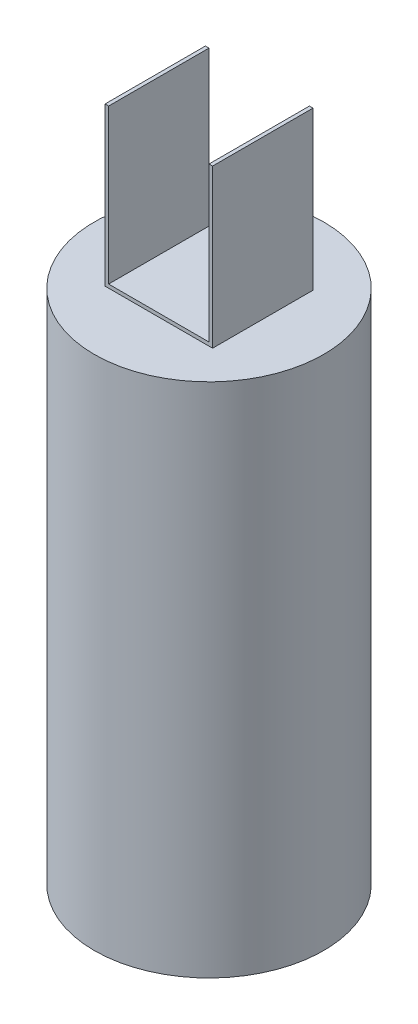
ISO-10303-21;
HEADER;
FILE_DESCRIPTION(('STEP AP214'),'2;1');
FILE_NAME('part.step','',(''),(''),'','','');
FILE_SCHEMA(('AUTOMOTIVE_DESIGN { 1 0 10303 214 1 1 1 1 }'));
ENDSEC;
DATA;
#1=APPLICATION_CONTEXT('core data for automotive mechanical design processes');
#2=APPLICATION_PROTOCOL_DEFINITION('international standard','automotive_design',2000,#1);
#3=PRODUCT_CONTEXT('',#1,'mechanical');
#4=PRODUCT('Part','Part','',(#3));
#5=PRODUCT_RELATED_PRODUCT_CATEGORY('part','',(#4));
#6=PRODUCT_DEFINITION_FORMATION('','',#4);
#7=PRODUCT_DEFINITION_CONTEXT('part definition',#1,'design');
#8=PRODUCT_DEFINITION('design','',#6,#7);
#9=PRODUCT_DEFINITION_SHAPE('','',#8);
#10=(LENGTH_UNIT() NAMED_UNIT(*) SI_UNIT(.MILLI.,.METRE.));
#11=(NAMED_UNIT(*) PLANE_ANGLE_UNIT() SI_UNIT($,.RADIAN.));
#12=(NAMED_UNIT(*) SI_UNIT($,.STERADIAN.) SOLID_ANGLE_UNIT());
#13=UNCERTAINTY_MEASURE_WITH_UNIT(LENGTH_MEASURE(1.E-05),#10,'distance_accuracy_value','');
#14=(GEOMETRIC_REPRESENTATION_CONTEXT(3) GLOBAL_UNCERTAINTY_ASSIGNED_CONTEXT((#13)) GLOBAL_UNIT_ASSIGNED_CONTEXT((#10,
#11,#12)) REPRESENTATION_CONTEXT('',''));
#15=CARTESIAN_POINT('',(0.,0.,0.));
#16=DIRECTION('',(0.,0.,1.));
#17=DIRECTION('',(1.,0.,0.));
#18=AXIS2_PLACEMENT_3D('',#15,#16,#17);
#19=CARTESIAN_POINT('',(0.,457.2,0.));
#20=DIRECTION('',(0.,1.,0.));
#21=DIRECTION('',(0.,0.,1.));
#22=AXIS2_PLACEMENT_3D('',#19,#20,#21);
#23=PLANE('',#22);
#24=CARTESIAN_POINT('',(0.,457.2,0.));
#25=DIRECTION('',(0.,1.,0.));
#26=DIRECTION('',(0.,0.,1.));
#27=AXIS2_PLACEMENT_3D('',#24,#25,#26);
#28=CIRCLE('',#27,101.6);
#29=CARTESIAN_POINT('',(0.,457.2,101.6));
#30=VERTEX_POINT('',#29);
#31=EDGE_CURVE('E11',#30,#30,#28,.T.);
#32=ORIENTED_EDGE('',*,*,#31,.T.);
#33=EDGE_LOOP('',(#32));
#34=FACE_BOUND('',#33,.T.);
#35=DIRECTION('',(1.,0.,0.));
#36=VECTOR('',#35,1.);
#37=CARTESIAN_POINT('',(0.,457.2,44.45));
#38=LINE('',#37,#36);
#39=CARTESIAN_POINT('',(-47.625,457.2,44.45));
#40=VERTEX_POINT('',#39);
#41=CARTESIAN_POINT('',(47.625,457.2,44.45));
#42=VERTEX_POINT('',#41);
#43=EDGE_CURVE('E137',#40,#42,#38,.T.);
#44=ORIENTED_EDGE('',*,*,#43,.F.);
#45=DIRECTION('',(0.,0.,1.));
#46=VECTOR('',#45,1.);
#47=CARTESIAN_POINT('',(-47.625,457.2,0.));
#48=LINE('',#47,#46);
#49=CARTESIAN_POINT('',(-47.625,457.2,-44.45));
#50=VERTEX_POINT('',#49);
#51=EDGE_CURVE('E157',#50,#40,#48,.T.);
#52=ORIENTED_EDGE('',*,*,#51,.F.);
#53=DIRECTION('',(1.,0.,0.));
#54=VECTOR('',#53,1.);
#55=CARTESIAN_POINT('',(0.,457.2,-44.45));
#56=LINE('',#55,#54);
#57=CARTESIAN_POINT('',(47.625,457.2,-44.45));
#58=VERTEX_POINT('',#57);
#59=EDGE_CURVE('E50',#50,#58,#56,.T.);
#60=ORIENTED_EDGE('',*,*,#59,.T.);
#61=DIRECTION('',(0.,0.,1.));
#62=VECTOR('',#61,1.);
#63=CARTESIAN_POINT('',(47.625,457.2,0.));
#64=LINE('',#63,#62);
#65=EDGE_CURVE('E57',#58,#42,#64,.T.);
#66=ORIENTED_EDGE('',*,*,#65,.T.);
#67=EDGE_LOOP('',(#44,#52,#60,#66));
#68=FACE_BOUND('',#67,.T.);
#69=ADVANCED_FACE('F35',(#34,#68),#23,.T.);
#70=CARTESIAN_POINT('',(0.,457.2,0.));
#71=DIRECTION('',(0.,-1.,0.));
#72=DIRECTION('',(0.,0.,-1.));
#73=AXIS2_PLACEMENT_3D('',#70,#71,#72);
#74=CYLINDRICAL_SURFACE('',#73,101.6);
#75=ORIENTED_EDGE('',*,*,#31,.F.);
#76=EDGE_LOOP('',(#75));
#77=FACE_BOUND('',#76,.T.);
#78=CARTESIAN_POINT('',(0.,0.,0.));
#79=DIRECTION('',(0.,1.,0.));
#80=DIRECTION('',(0.,0.,1.));
#81=AXIS2_PLACEMENT_3D('',#78,#79,#80);
#82=CIRCLE('',#81,101.6);
#83=CARTESIAN_POINT('',(0.,0.,101.6));
#84=VERTEX_POINT('',#83);
#85=EDGE_CURVE('E39',#84,#84,#82,.T.);
#86=ORIENTED_EDGE('',*,*,#85,.T.);
#87=EDGE_LOOP('',(#86));
#88=FACE_BOUND('',#87,.T.);
#89=ADVANCED_FACE('F37',(#77,#88),#74,.T.);
#90=CARTESIAN_POINT('',(0.,0.,0.));
#91=DIRECTION('',(0.,1.,0.));
#92=DIRECTION('',(0.,0.,1.));
#93=AXIS2_PLACEMENT_3D('',#90,#91,#92);
#94=PLANE('',#93);
#95=ORIENTED_EDGE('',*,*,#85,.F.);
#96=EDGE_LOOP('',(#95));
#97=FACE_BOUND('',#96,.T.);
#98=ADVANCED_FACE('F203',(#97),#94,.F.);
#99=CARTESIAN_POINT('',(44.45,596.9,0.));
#100=DIRECTION('',(-1.,0.,0.));
#101=DIRECTION('',(0.,0.,1.));
#102=AXIS2_PLACEMENT_3D('',#99,#100,#101);
#103=PLANE('',#102);
#104=DIRECTION('',(0.,0.,-1.));
#105=VECTOR('',#104,1.);
#106=CARTESIAN_POINT('',(44.45,460.375,0.));
#107=LINE('',#106,#105);
#108=CARTESIAN_POINT('',(44.45,460.375,44.45));
#109=VERTEX_POINT('',#108);
#110=CARTESIAN_POINT('',(44.45,460.375,-44.45));
#111=VERTEX_POINT('',#110);
#112=EDGE_CURVE('E102',#109,#111,#107,.T.);
#113=ORIENTED_EDGE('',*,*,#112,.F.);
#114=DIRECTION('',(0.,-1.,0.));
#115=VECTOR('',#114,1.);
#116=CARTESIAN_POINT('',(44.45,596.9,44.45));
#117=LINE('',#116,#115);
#118=CARTESIAN_POINT('',(44.45,596.9,44.45));
#119=VERTEX_POINT('',#118);
#120=EDGE_CURVE('E115',#119,#109,#117,.T.);
#121=ORIENTED_EDGE('',*,*,#120,.F.);
#122=DIRECTION('',(0.,0.,-1.));
#123=VECTOR('',#122,1.);
#124=CARTESIAN_POINT('',(44.45,596.9,0.));
#125=LINE('',#124,#123);
#126=CARTESIAN_POINT('',(44.45,596.9,-44.45));
#127=VERTEX_POINT('',#126);
#128=EDGE_CURVE('E135',#119,#127,#125,.T.);
#129=ORIENTED_EDGE('',*,*,#128,.T.);
#130=DIRECTION('',(0.,-1.,0.));
#131=VECTOR('',#130,1.);
#132=CARTESIAN_POINT('',(44.45,596.9,-44.45));
#133=LINE('',#132,#131);
#134=EDGE_CURVE('E117',#127,#111,#133,.T.);
#135=ORIENTED_EDGE('',*,*,#134,.T.);
#136=EDGE_LOOP('',(#113,#121,#129,#135));
#137=FACE_BOUND('',#136,.T.);
#138=ADVANCED_FACE('F113',(#137),#103,.T.);
#139=CARTESIAN_POINT('',(0.,596.9,44.45));
#140=DIRECTION('',(0.,0.,-1.));
#141=DIRECTION('',(-1.,0.,0.));
#142=AXIS2_PLACEMENT_3D('',#139,#140,#141);
#143=PLANE('',#142);
#144=ORIENTED_EDGE('',*,*,#43,.T.);
#145=DIRECTION('',(0.,-1.,0.));
#146=VECTOR('',#145,1.);
#147=CARTESIAN_POINT('',(47.625,596.9,44.45));
#148=LINE('',#147,#146);
#149=CARTESIAN_POINT('',(47.625,596.9,44.45));
#150=VERTEX_POINT('',#149);
#151=EDGE_CURVE('E125',#150,#42,#148,.T.);
#152=ORIENTED_EDGE('',*,*,#151,.F.);
#153=DIRECTION('',(1.,0.,0.));
#154=VECTOR('',#153,1.);
#155=CARTESIAN_POINT('',(0.,596.9,44.45));
#156=LINE('',#155,#154);
#157=EDGE_CURVE('E123',#119,#150,#156,.T.);
#158=ORIENTED_EDGE('',*,*,#157,.F.);
#159=ORIENTED_EDGE('',*,*,#120,.T.);
#160=DIRECTION('',(1.,0.,0.));
#161=VECTOR('',#160,1.);
#162=CARTESIAN_POINT('',(0.,460.375,44.45));
#163=LINE('',#162,#161);
#164=CARTESIAN_POINT('',(-44.45,460.375,44.45));
#165=VERTEX_POINT('',#164);
#166=EDGE_CURVE('E99',#165,#109,#163,.T.);
#167=ORIENTED_EDGE('',*,*,#166,.F.);
#168=DIRECTION('',(0.,-1.,0.));
#169=VECTOR('',#168,1.);
#170=CARTESIAN_POINT('',(-44.45,596.9,44.45));
#171=LINE('',#170,#169);
#172=CARTESIAN_POINT('',(-44.45,596.9,44.45));
#173=VERTEX_POINT('',#172);
#174=EDGE_CURVE('E139',#173,#165,#171,.T.);
#175=ORIENTED_EDGE('',*,*,#174,.F.);
#176=DIRECTION('',(1.,0.,0.));
#177=VECTOR('',#176,1.);
#178=CARTESIAN_POINT('',(0.,596.9,44.45));
#179=LINE('',#178,#177);
#180=CARTESIAN_POINT('',(-47.625,596.9,44.45));
#181=VERTEX_POINT('',#180);
#182=EDGE_CURVE('E160',#181,#173,#179,.T.);
#183=ORIENTED_EDGE('',*,*,#182,.F.);
#184=DIRECTION('',(0.,-1.,0.));
#185=VECTOR('',#184,1.);
#186=CARTESIAN_POINT('',(-47.625,596.9,44.45));
#187=LINE('',#186,#185);
#188=EDGE_CURVE('E153',#181,#40,#187,.T.);
#189=ORIENTED_EDGE('',*,*,#188,.T.);
#190=EDGE_LOOP('',(#144,#152,#158,#159,#167,#175,#183,#189));
#191=FACE_BOUND('',#190,.T.);
#192=ADVANCED_FACE('F121',(#191),#143,.F.);
#193=CARTESIAN_POINT('',(47.625,596.9,0.));
#194=DIRECTION('',(1.,0.,0.));
#195=DIRECTION('',(0.,0.,-1.));
#196=AXIS2_PLACEMENT_3D('',#193,#194,#195);
#197=PLANE('',#196);
#198=ORIENTED_EDGE('',*,*,#65,.F.);
#199=DIRECTION('',(0.,-1.,0.));
#200=VECTOR('',#199,1.);
#201=CARTESIAN_POINT('',(47.625,596.9,-44.45));
#202=LINE('',#201,#200);
#203=CARTESIAN_POINT('',(47.625,596.9,-44.45));
#204=VERTEX_POINT('',#203);
#205=EDGE_CURVE('E128',#204,#58,#202,.T.);
#206=ORIENTED_EDGE('',*,*,#205,.F.);
#207=DIRECTION('',(0.,0.,1.));
#208=VECTOR('',#207,1.);
#209=CARTESIAN_POINT('',(47.625,596.9,0.));
#210=LINE('',#209,#208);
#211=EDGE_CURVE('E142',#204,#150,#210,.T.);
#212=ORIENTED_EDGE('',*,*,#211,.T.);
#213=ORIENTED_EDGE('',*,*,#151,.T.);
#214=EDGE_LOOP('',(#198,#206,#212,#213));
#215=FACE_BOUND('',#214,.T.);
#216=ADVANCED_FACE('F185',(#215),#197,.T.);
#217=CARTESIAN_POINT('',(0.,596.9,-44.45));
#218=DIRECTION('',(0.,0.,-1.));
#219=DIRECTION('',(-1.,0.,0.));
#220=AXIS2_PLACEMENT_3D('',#217,#218,#219);
#221=PLANE('',#220);
#222=ORIENTED_EDGE('',*,*,#59,.F.);
#223=DIRECTION('',(0.,-1.,0.));
#224=VECTOR('',#223,1.);
#225=CARTESIAN_POINT('',(-47.625,596.9,-44.45));
#226=LINE('',#225,#224);
#227=CARTESIAN_POINT('',(-47.625,596.9,-44.45));
#228=VERTEX_POINT('',#227);
#229=EDGE_CURVE('E151',#228,#50,#226,.T.);
#230=ORIENTED_EDGE('',*,*,#229,.F.);
#231=DIRECTION('',(1.,0.,0.));
#232=VECTOR('',#231,1.);
#233=CARTESIAN_POINT('',(0.,596.9,-44.45));
#234=LINE('',#233,#232);
#235=CARTESIAN_POINT('',(-44.45,596.9,-44.45));
#236=VERTEX_POINT('',#235);
#237=EDGE_CURVE('E162',#228,#236,#234,.T.);
#238=ORIENTED_EDGE('',*,*,#237,.T.);
#239=DIRECTION('',(0.,-1.,0.));
#240=VECTOR('',#239,1.);
#241=CARTESIAN_POINT('',(-44.45,596.9,-44.45));
#242=LINE('',#241,#240);
#243=CARTESIAN_POINT('',(-44.45,460.375,-44.45));
#244=VERTEX_POINT('',#243);
#245=EDGE_CURVE('E148',#236,#244,#242,.T.);
#246=ORIENTED_EDGE('',*,*,#245,.T.);
#247=DIRECTION('',(1.,0.,0.));
#248=VECTOR('',#247,1.);
#249=CARTESIAN_POINT('',(0.,460.375,-44.45));
#250=LINE('',#249,#248);
#251=EDGE_CURVE('E118',#244,#111,#250,.T.);
#252=ORIENTED_EDGE('',*,*,#251,.T.);
#253=ORIENTED_EDGE('',*,*,#134,.F.);
#254=DIRECTION('',(1.,0.,0.));
#255=VECTOR('',#254,1.);
#256=CARTESIAN_POINT('',(0.,596.9,-44.45));
#257=LINE('',#256,#255);
#258=EDGE_CURVE('E133',#127,#204,#257,.T.);
#259=ORIENTED_EDGE('',*,*,#258,.T.);
#260=ORIENTED_EDGE('',*,*,#205,.T.);
#261=EDGE_LOOP('',(#222,#230,#238,#246,#252,#253,#259,#260));
#262=FACE_BOUND('',#261,.T.);
#263=ADVANCED_FACE('F170',(#262),#221,.T.);
#264=CARTESIAN_POINT('',(0.,596.9,0.));
#265=DIRECTION('',(0.,1.,0.));
#266=DIRECTION('',(0.,0.,1.));
#267=AXIS2_PLACEMENT_3D('',#264,#265,#266);
#268=PLANE('',#267);
#269=ORIENTED_EDGE('',*,*,#128,.F.);
#270=ORIENTED_EDGE('',*,*,#157,.T.);
#271=ORIENTED_EDGE('',*,*,#211,.F.);
#272=ORIENTED_EDGE('',*,*,#258,.F.);
#273=EDGE_LOOP('',(#269,#270,#271,#272));
#274=FACE_BOUND('',#273,.T.);
#275=ADVANCED_FACE('F188',(#274),#268,.T.);
#276=CARTESIAN_POINT('',(-44.45,596.9,0.));
#277=DIRECTION('',(-1.,0.,0.));
#278=DIRECTION('',(0.,0.,1.));
#279=AXIS2_PLACEMENT_3D('',#276,#277,#278);
#280=PLANE('',#279);
#281=ORIENTED_EDGE('',*,*,#174,.T.);
#282=DIRECTION('',(0.,0.,-1.));
#283=VECTOR('',#282,1.);
#284=CARTESIAN_POINT('',(-44.45,460.375,0.));
#285=LINE('',#284,#283);
#286=EDGE_CURVE('E105',#165,#244,#285,.T.);
#287=ORIENTED_EDGE('',*,*,#286,.T.);
#288=ORIENTED_EDGE('',*,*,#245,.F.);
#289=DIRECTION('',(0.,0.,-1.));
#290=VECTOR('',#289,1.);
#291=CARTESIAN_POINT('',(-44.45,596.9,0.));
#292=LINE('',#291,#290);
#293=EDGE_CURVE('E165',#173,#236,#292,.T.);
#294=ORIENTED_EDGE('',*,*,#293,.F.);
#295=EDGE_LOOP('',(#281,#287,#288,#294));
#296=FACE_BOUND('',#295,.T.);
#297=ADVANCED_FACE('F173',(#296),#280,.F.);
#298=CARTESIAN_POINT('',(-47.625,596.9,0.));
#299=DIRECTION('',(1.,0.,0.));
#300=DIRECTION('',(0.,0.,-1.));
#301=AXIS2_PLACEMENT_3D('',#298,#299,#300);
#302=PLANE('',#301);
#303=ORIENTED_EDGE('',*,*,#51,.T.);
#304=ORIENTED_EDGE('',*,*,#188,.F.);
#305=DIRECTION('',(0.,0.,1.));
#306=VECTOR('',#305,1.);
#307=CARTESIAN_POINT('',(-47.625,596.9,0.));
#308=LINE('',#307,#306);
#309=EDGE_CURVE('E156',#228,#181,#308,.T.);
#310=ORIENTED_EDGE('',*,*,#309,.F.);
#311=ORIENTED_EDGE('',*,*,#229,.T.);
#312=EDGE_LOOP('',(#303,#304,#310,#311));
#313=FACE_BOUND('',#312,.T.);
#314=ADVANCED_FACE('F181',(#313),#302,.F.);
#315=CARTESIAN_POINT('',(0.,596.9,0.));
#316=DIRECTION('',(0.,1.,0.));
#317=DIRECTION('',(0.,0.,1.));
#318=AXIS2_PLACEMENT_3D('',#315,#316,#317);
#319=PLANE('',#318);
#320=ORIENTED_EDGE('',*,*,#182,.T.);
#321=ORIENTED_EDGE('',*,*,#293,.T.);
#322=ORIENTED_EDGE('',*,*,#237,.F.);
#323=ORIENTED_EDGE('',*,*,#309,.T.);
#324=EDGE_LOOP('',(#320,#321,#322,#323));
#325=FACE_BOUND('',#324,.T.);
#326=ADVANCED_FACE('F177',(#325),#319,.T.);
#327=CARTESIAN_POINT('',(0.,460.375,0.));
#328=DIRECTION('',(0.,1.,0.));
#329=DIRECTION('',(0.,0.,1.));
#330=AXIS2_PLACEMENT_3D('',#327,#328,#329);
#331=PLANE('',#330);
#332=ORIENTED_EDGE('',*,*,#166,.T.);
#333=ORIENTED_EDGE('',*,*,#112,.T.);
#334=ORIENTED_EDGE('',*,*,#251,.F.);
#335=ORIENTED_EDGE('',*,*,#286,.F.);
#336=EDGE_LOOP('',(#332,#333,#334,#335));
#337=FACE_BOUND('',#336,.T.);
#338=ADVANCED_FACE('F101',(#337),#331,.T.);
#339=CLOSED_SHELL('',(#69,#89,#98,#138,#192,#216,#263,#275,#297,#314,#326,#338));
#340=MANIFOLD_SOLID_BREP('B2',#339);
#341=ADVANCED_BREP_SHAPE_REPRESENTATION('',(#18,#340),#14);
#342=SHAPE_DEFINITION_REPRESENTATION(#9,#341);
ENDSEC;
END-ISO-10303-21;
